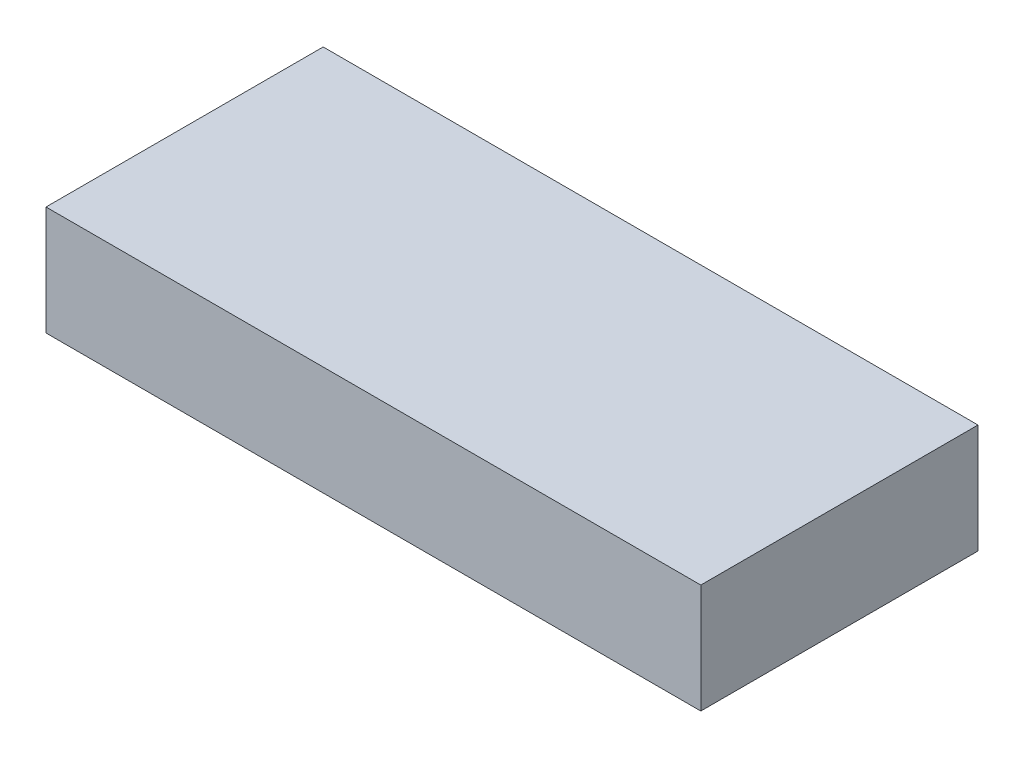
ISO-10303-21;
HEADER;
FILE_DESCRIPTION(('STEP AP214'),'2;1');
FILE_NAME('part.step','',(''),(''),'','','');
FILE_SCHEMA(('AUTOMOTIVE_DESIGN { 1 0 10303 214 1 1 1 1 }'));
ENDSEC;
DATA;
#1=APPLICATION_CONTEXT('core data for automotive mechanical design processes');
#2=APPLICATION_PROTOCOL_DEFINITION('international standard','automotive_design',2000,#1);
#3=PRODUCT_CONTEXT('',#1,'mechanical');
#4=PRODUCT('Part','Part','',(#3));
#5=PRODUCT_RELATED_PRODUCT_CATEGORY('part','',(#4));
#6=PRODUCT_DEFINITION_FORMATION('','',#4);
#7=PRODUCT_DEFINITION_CONTEXT('part definition',#1,'design');
#8=PRODUCT_DEFINITION('design','',#6,#7);
#9=PRODUCT_DEFINITION_SHAPE('','',#8);
#10=(LENGTH_UNIT() NAMED_UNIT(*) SI_UNIT(.MILLI.,.METRE.));
#11=(NAMED_UNIT(*) PLANE_ANGLE_UNIT() SI_UNIT($,.RADIAN.));
#12=(NAMED_UNIT(*) SI_UNIT($,.STERADIAN.) SOLID_ANGLE_UNIT());
#13=UNCERTAINTY_MEASURE_WITH_UNIT(LENGTH_MEASURE(1.E-05),#10,'distance_accuracy_value','');
#14=(GEOMETRIC_REPRESENTATION_CONTEXT(3) GLOBAL_UNCERTAINTY_ASSIGNED_CONTEXT((#13)) GLOBAL_UNIT_ASSIGNED_CONTEXT((#10,
#11,#12)) REPRESENTATION_CONTEXT('',''));
#15=CARTESIAN_POINT('',(0.,0.,0.));
#16=DIRECTION('',(0.,0.,1.));
#17=DIRECTION('',(1.,0.,0.));
#18=AXIS2_PLACEMENT_3D('',#15,#16,#17);
#19=CARTESIAN_POINT('',(30.,5.,12.7));
#20=DIRECTION('',(-1.,0.,0.));
#21=DIRECTION('',(0.,0.,1.));
#22=AXIS2_PLACEMENT_3D('',#19,#20,#21);
#23=PLANE('',#22);
#24=DIRECTION('',(0.,0.,-1.));
#25=VECTOR('',#24,1.);
#26=CARTESIAN_POINT('',(30.,-5.,12.7));
#27=LINE('',#26,#25);
#28=CARTESIAN_POINT('',(30.,-5.,12.7));
#29=VERTEX_POINT('',#28);
#30=CARTESIAN_POINT('',(30.,-5.,-12.7));
#31=VERTEX_POINT('',#30);
#32=EDGE_CURVE('E107',#29,#31,#27,.T.);
#33=ORIENTED_EDGE('',*,*,#32,.T.);
#34=DIRECTION('',(0.,-1.,0.));
#35=VECTOR('',#34,1.);
#36=CARTESIAN_POINT('',(30.,5.,-12.7));
#37=LINE('',#36,#35);
#38=CARTESIAN_POINT('',(30.,5.,-12.7));
#39=VERTEX_POINT('',#38);
#40=EDGE_CURVE('E11',#39,#31,#37,.T.);
#41=ORIENTED_EDGE('',*,*,#40,.F.);
#42=DIRECTION('',(0.,0.,-1.));
#43=VECTOR('',#42,1.);
#44=CARTESIAN_POINT('',(30.,5.,12.7));
#45=LINE('',#44,#43);
#46=CARTESIAN_POINT('',(30.,5.,12.7));
#47=VERTEX_POINT('',#46);
#48=EDGE_CURVE('E91',#47,#39,#45,.T.);
#49=ORIENTED_EDGE('',*,*,#48,.F.);
#50=DIRECTION('',(0.,-1.,0.));
#51=VECTOR('',#50,1.);
#52=CARTESIAN_POINT('',(30.,5.,12.7));
#53=LINE('',#52,#51);
#54=EDGE_CURVE('E103',#47,#29,#53,.T.);
#55=ORIENTED_EDGE('',*,*,#54,.T.);
#56=EDGE_LOOP('',(#33,#41,#49,#55));
#57=FACE_BOUND('',#56,.T.);
#58=ADVANCED_FACE('F39',(#57),#23,.F.);
#59=CARTESIAN_POINT('',(-30.,5.,-12.7));
#60=DIRECTION('',(0.,0.,1.));
#61=DIRECTION('',(1.,0.,0.));
#62=AXIS2_PLACEMENT_3D('',#59,#60,#61);
#63=PLANE('',#62);
#64=DIRECTION('',(-1.,0.,0.));
#65=VECTOR('',#64,1.);
#66=CARTESIAN_POINT('',(-30.,-5.,-12.7));
#67=LINE('',#66,#65);
#68=CARTESIAN_POINT('',(-30.,-5.,-12.7));
#69=VERTEX_POINT('',#68);
#70=EDGE_CURVE('E96',#31,#69,#67,.T.);
#71=ORIENTED_EDGE('',*,*,#70,.T.);
#72=DIRECTION('',(0.,-1.,0.));
#73=VECTOR('',#72,1.);
#74=CARTESIAN_POINT('',(-30.,5.,-12.7));
#75=LINE('',#74,#73);
#76=CARTESIAN_POINT('',(-30.,5.,-12.7));
#77=VERTEX_POINT('',#76);
#78=EDGE_CURVE('E48',#77,#69,#75,.T.);
#79=ORIENTED_EDGE('',*,*,#78,.F.);
#80=DIRECTION('',(-1.,0.,0.));
#81=VECTOR('',#80,1.);
#82=CARTESIAN_POINT('',(-30.,5.,-12.7));
#83=LINE('',#82,#81);
#84=EDGE_CURVE('E86',#39,#77,#83,.T.);
#85=ORIENTED_EDGE('',*,*,#84,.F.);
#86=ORIENTED_EDGE('',*,*,#40,.T.);
#87=EDGE_LOOP('',(#71,#79,#85,#86));
#88=FACE_BOUND('',#87,.T.);
#89=ADVANCED_FACE('F95',(#88),#63,.F.);
#90=CARTESIAN_POINT('',(-30.,5.,12.7));
#91=DIRECTION('',(1.,0.,0.));
#92=DIRECTION('',(0.,0.,-1.));
#93=AXIS2_PLACEMENT_3D('',#90,#91,#92);
#94=PLANE('',#93);
#95=DIRECTION('',(0.,0.,1.));
#96=VECTOR('',#95,1.);
#97=CARTESIAN_POINT('',(-30.,-5.,12.7));
#98=LINE('',#97,#96);
#99=CARTESIAN_POINT('',(-30.,-5.,12.7));
#100=VERTEX_POINT('',#99);
#101=EDGE_CURVE('E73',#69,#100,#98,.T.);
#102=ORIENTED_EDGE('',*,*,#101,.T.);
#103=DIRECTION('',(0.,-1.,0.));
#104=VECTOR('',#103,1.);
#105=CARTESIAN_POINT('',(-30.,5.,12.7));
#106=LINE('',#105,#104);
#107=CARTESIAN_POINT('',(-30.,5.,12.7));
#108=VERTEX_POINT('',#107);
#109=EDGE_CURVE('E98',#108,#100,#106,.T.);
#110=ORIENTED_EDGE('',*,*,#109,.F.);
#111=DIRECTION('',(0.,0.,1.));
#112=VECTOR('',#111,1.);
#113=CARTESIAN_POINT('',(-30.,5.,12.7));
#114=LINE('',#113,#112);
#115=EDGE_CURVE('E89',#77,#108,#114,.T.);
#116=ORIENTED_EDGE('',*,*,#115,.F.);
#117=ORIENTED_EDGE('',*,*,#78,.T.);
#118=EDGE_LOOP('',(#102,#110,#116,#117));
#119=FACE_BOUND('',#118,.T.);
#120=ADVANCED_FACE('F99',(#119),#94,.F.);
#121=CARTESIAN_POINT('',(-30.,5.,12.7));
#122=DIRECTION('',(0.,0.,-1.));
#123=DIRECTION('',(-1.,0.,0.));
#124=AXIS2_PLACEMENT_3D('',#121,#122,#123);
#125=PLANE('',#124);
#126=DIRECTION('',(1.,0.,0.));
#127=VECTOR('',#126,1.);
#128=CARTESIAN_POINT('',(-30.,-5.,12.7));
#129=LINE('',#128,#127);
#130=EDGE_CURVE('E79',#100,#29,#129,.T.);
#131=ORIENTED_EDGE('',*,*,#130,.T.);
#132=ORIENTED_EDGE('',*,*,#54,.F.);
#133=DIRECTION('',(1.,0.,0.));
#134=VECTOR('',#133,1.);
#135=CARTESIAN_POINT('',(-30.,5.,12.7));
#136=LINE('',#135,#134);
#137=EDGE_CURVE('E56',#108,#47,#136,.T.);
#138=ORIENTED_EDGE('',*,*,#137,.F.);
#139=ORIENTED_EDGE('',*,*,#109,.T.);
#140=EDGE_LOOP('',(#131,#132,#138,#139));
#141=FACE_BOUND('',#140,.T.);
#142=ADVANCED_FACE('F120',(#141),#125,.F.);
#143=CARTESIAN_POINT('',(0.,5.,0.));
#144=DIRECTION('',(0.,-1.,0.));
#145=DIRECTION('',(0.,0.,-1.));
#146=AXIS2_PLACEMENT_3D('',#143,#144,#145);
#147=PLANE('',#146);
#148=ORIENTED_EDGE('',*,*,#48,.T.);
#149=ORIENTED_EDGE('',*,*,#84,.T.);
#150=ORIENTED_EDGE('',*,*,#115,.T.);
#151=ORIENTED_EDGE('',*,*,#137,.T.);
#152=EDGE_LOOP('',(#148,#149,#150,#151));
#153=FACE_BOUND('',#152,.T.);
#154=ADVANCED_FACE('F87',(#153),#147,.F.);
#155=CARTESIAN_POINT('',(0.,-5.,0.));
#156=DIRECTION('',(0.,-1.,0.));
#157=DIRECTION('',(0.,0.,-1.));
#158=AXIS2_PLACEMENT_3D('',#155,#156,#157);
#159=PLANE('',#158);
#160=ORIENTED_EDGE('',*,*,#32,.F.);
#161=ORIENTED_EDGE('',*,*,#130,.F.);
#162=ORIENTED_EDGE('',*,*,#101,.F.);
#163=ORIENTED_EDGE('',*,*,#70,.F.);
#164=EDGE_LOOP('',(#160,#161,#162,#163));
#165=FACE_BOUND('',#164,.T.);
#166=ADVANCED_FACE('F123',(#165),#159,.T.);
#167=CLOSED_SHELL('',(#58,#89,#120,#142,#154,#166));
#168=MANIFOLD_SOLID_BREP('B2',#167);
#169=ADVANCED_BREP_SHAPE_REPRESENTATION('',(#18,#168),#14);
#170=SHAPE_DEFINITION_REPRESENTATION(#9,#169);
ENDSEC;
END-ISO-10303-21;
